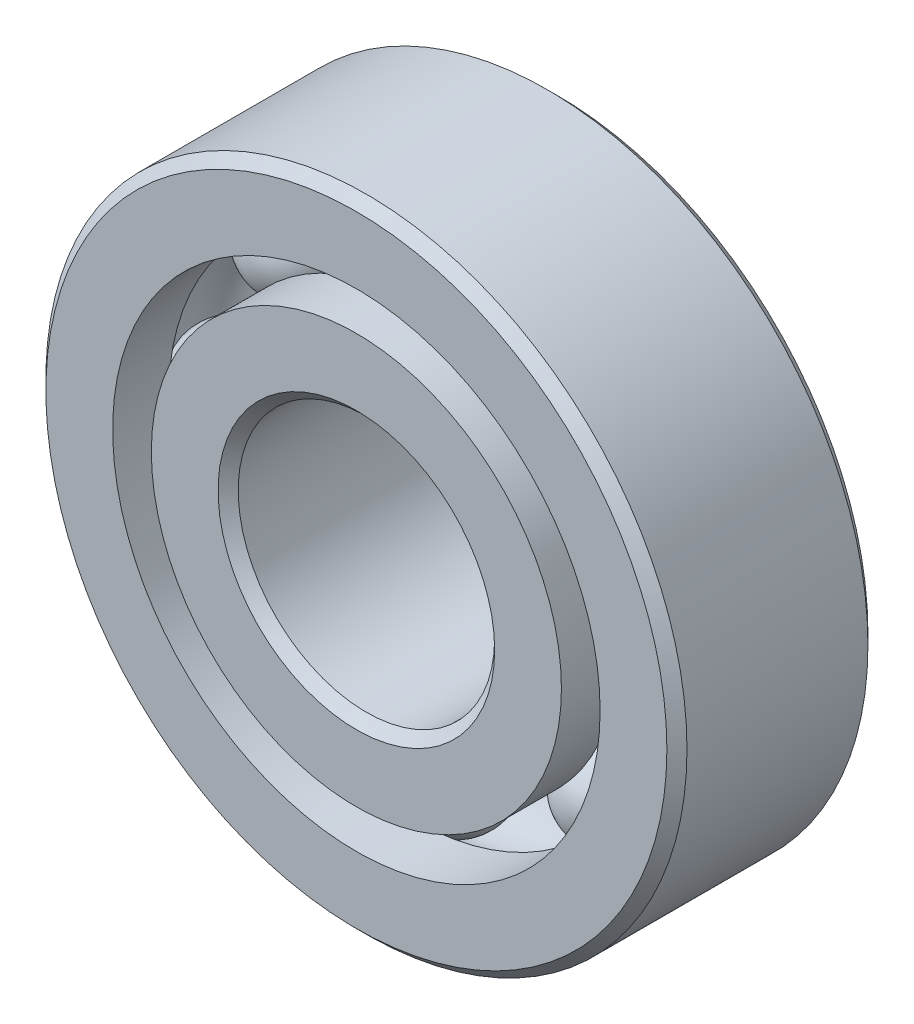
ISO-10303-21;
HEADER;
FILE_DESCRIPTION(('STEP AP214'),'2;1');
FILE_NAME('part.step','',(''),(''),'','','');
FILE_SCHEMA(('AUTOMOTIVE_DESIGN { 1 0 10303 214 1 1 1 1 }'));
ENDSEC;
DATA;
#1=APPLICATION_CONTEXT('core data for automotive mechanical design processes');
#2=APPLICATION_PROTOCOL_DEFINITION('international standard','automotive_design',2000,#1);
#3=PRODUCT_CONTEXT('',#1,'mechanical');
#4=PRODUCT('Part','Part','',(#3));
#5=PRODUCT_RELATED_PRODUCT_CATEGORY('part','',(#4));
#6=PRODUCT_DEFINITION_FORMATION('','',#4);
#7=PRODUCT_DEFINITION_CONTEXT('part definition',#1,'design');
#8=PRODUCT_DEFINITION('design','',#6,#7);
#9=PRODUCT_DEFINITION_SHAPE('','',#8);
#10=(LENGTH_UNIT() NAMED_UNIT(*) SI_UNIT(.MILLI.,.METRE.));
#11=(NAMED_UNIT(*) PLANE_ANGLE_UNIT() SI_UNIT($,.RADIAN.));
#12=(NAMED_UNIT(*) SI_UNIT($,.STERADIAN.) SOLID_ANGLE_UNIT());
#13=UNCERTAINTY_MEASURE_WITH_UNIT(LENGTH_MEASURE(1.E-05),#10,'distance_accuracy_value','');
#14=(GEOMETRIC_REPRESENTATION_CONTEXT(3) GLOBAL_UNCERTAINTY_ASSIGNED_CONTEXT((#13)) GLOBAL_UNIT_ASSIGNED_CONTEXT((#10,
#11,#12)) REPRESENTATION_CONTEXT('',''));
#15=CARTESIAN_POINT('',(0.,0.,0.));
#16=DIRECTION('',(0.,0.,1.));
#17=DIRECTION('',(1.,0.,0.));
#18=AXIS2_PLACEMENT_3D('',#15,#16,#17);
#19=CARTESIAN_POINT('',(-3.92886205296771,3.9288620529678,0.));
#20=DIRECTION('',(0.,0.,1.));
#21=DIRECTION('',(-0.707106781186539,0.707106781186556,0.));
#22=AXIS2_PLACEMENT_3D('',#19,#20,#21);
#23=SPHERICAL_SURFACE('',#22,1.20554465033679);
#24=CARTESIAN_POINT('',(-3.92886205296771,3.9288620529678,1.20554465033679));
#25=VERTEX_POINT('',#24);
#26=VERTEX_LOOP('',#25);
#27=FACE_BOUND('',#26,.T.);
#28=ADVANCED_FACE('F37',(#27),#23,.T.);
#29=CLOSED_SHELL('',(#28));
#30=MANIFOLD_SOLID_BREP('B2',#29);
#31=CARTESIAN_POINT('',(-5.55625,0.,0.));
#32=DIRECTION('',(0.,0.,1.));
#33=DIRECTION('',(-1.,0.,0.));
#34=AXIS2_PLACEMENT_3D('',#31,#32,#33);
#35=SPHERICAL_SURFACE('',#34,1.20554465033679);
#36=CARTESIAN_POINT('',(-5.55625,0.,1.20554465033679));
#37=VERTEX_POINT('',#36);
#38=VERTEX_LOOP('',#37);
#39=FACE_BOUND('',#38,.T.);
#40=ADVANCED_FACE('F57',(#39),#35,.T.);
#41=CLOSED_SHELL('',(#40));
#42=MANIFOLD_SOLID_BREP('B6',#41);
#43=CARTESIAN_POINT('',(-3.92886205296779,-3.92886205296772,0.));
#44=DIRECTION('',(0.,0.,1.));
#45=DIRECTION('',(-0.707106781186554,-0.707106781186541,0.));
#46=AXIS2_PLACEMENT_3D('',#43,#44,#45);
#47=SPHERICAL_SURFACE('',#46,1.20554465033679);
#48=CARTESIAN_POINT('',(-3.92886205296779,-3.92886205296772,1.20554465033679));
#49=VERTEX_POINT('',#48);
#50=VERTEX_LOOP('',#49);
#51=FACE_BOUND('',#50,.T.);
#52=ADVANCED_FACE('F77',(#51),#47,.T.);
#53=CLOSED_SHELL('',(#52));
#54=MANIFOLD_SOLID_BREP('B33',#53);
#55=CARTESIAN_POINT('',(0.,-5.55625,0.));
#56=DIRECTION('',(0.,0.,1.));
#57=DIRECTION('',(0.,-1.,0.));
#58=AXIS2_PLACEMENT_3D('',#55,#56,#57);
#59=SPHERICAL_SURFACE('',#58,1.20554465033679);
#60=CARTESIAN_POINT('',(0.,-5.55625,1.20554465033679));
#61=VERTEX_POINT('',#60);
#62=VERTEX_LOOP('',#61);
#63=FACE_BOUND('',#62,.T.);
#64=ADVANCED_FACE('F97',(#63),#59,.T.);
#65=CLOSED_SHELL('',(#64));
#66=MANIFOLD_SOLID_BREP('B53',#65);
#67=CARTESIAN_POINT('',(3.92886205296773,-3.92886205296777,0.));
#68=DIRECTION('',(0.,0.,1.));
#69=DIRECTION('',(0.707106781186544,-0.707106781186551,0.));
#70=AXIS2_PLACEMENT_3D('',#67,#68,#69);
#71=SPHERICAL_SURFACE('',#70,1.20554465033679);
#72=CARTESIAN_POINT('',(3.92886205296773,-3.92886205296777,1.20554465033679));
#73=VERTEX_POINT('',#72);
#74=VERTEX_LOOP('',#73);
#75=FACE_BOUND('',#74,.T.);
#76=ADVANCED_FACE('F117',(#75),#71,.T.);
#77=CLOSED_SHELL('',(#76));
#78=MANIFOLD_SOLID_BREP('B73',#77);
#79=CARTESIAN_POINT('',(5.55625,0.,0.));
#80=DIRECTION('',(0.,0.,1.));
#81=DIRECTION('',(1.,0.,0.));
#82=AXIS2_PLACEMENT_3D('',#79,#80,#81);
#83=SPHERICAL_SURFACE('',#82,1.20554465033679);
#84=CARTESIAN_POINT('',(5.55625,0.,1.20554465033679));
#85=VERTEX_POINT('',#84);
#86=VERTEX_LOOP('',#85);
#87=FACE_BOUND('',#86,.T.);
#88=ADVANCED_FACE('F137',(#87),#83,.T.);
#89=CLOSED_SHELL('',(#88));
#90=MANIFOLD_SOLID_BREP('B93',#89);
#91=CARTESIAN_POINT('',(3.92886205296776,3.92886205296775,0.));
#92=DIRECTION('',(0.,0.,1.));
#93=DIRECTION('',(0.707106781186549,0.707106781186546,0.));
#94=AXIS2_PLACEMENT_3D('',#91,#92,#93);
#95=SPHERICAL_SURFACE('',#94,1.20554465033679);
#96=CARTESIAN_POINT('',(3.92886205296776,3.92886205296775,1.20554465033679));
#97=VERTEX_POINT('',#96);
#98=VERTEX_LOOP('',#97);
#99=FACE_BOUND('',#98,.T.);
#100=ADVANCED_FACE('F157',(#99),#95,.T.);
#101=CLOSED_SHELL('',(#100));
#102=MANIFOLD_SOLID_BREP('B113',#101);
#103=CARTESIAN_POINT('',(0.,5.55625,0.));
#104=DIRECTION('',(0.,0.,1.));
#105=DIRECTION('',(0.,1.,0.));
#106=AXIS2_PLACEMENT_3D('',#103,#104,#105);
#107=SPHERICAL_SURFACE('',#106,1.20554465033679);
#108=CARTESIAN_POINT('',(0.,5.55625,1.20554465033679));
#109=VERTEX_POINT('',#108);
#110=VERTEX_LOOP('',#109);
#111=FACE_BOUND('',#110,.T.);
#112=ADVANCED_FACE('F179',(#111),#107,.T.);
#113=CLOSED_SHELL('',(#112));
#114=MANIFOLD_SOLID_BREP('B133',#113);
#115=CARTESIAN_POINT('',(0.,5.07727857142857,2.4892));
#116=DIRECTION('',(0.,0.,-1.));
#117=DIRECTION('',(-1.,0.,0.));
#118=AXIS2_PLACEMENT_3D('',#115,#116,#117);
#119=PLANE('',#118);
#120=CARTESIAN_POINT('',(0.,0.,2.4892));
#121=DIRECTION('',(0.,0.,1.));
#122=DIRECTION('',(1.,0.,0.));
#123=AXIS2_PLACEMENT_3D('',#120,#121,#122);
#124=CIRCLE('',#123,3.42392);
#125=CARTESIAN_POINT('',(3.42392,0.,2.4892));
#126=VERTEX_POINT('',#125);
#127=EDGE_CURVE('E226',#126,#126,#124,.T.);
#128=ORIENTED_EDGE('',*,*,#127,.F.);
#129=EDGE_LOOP('',(#128));
#130=FACE_BOUND('',#129,.T.);
#131=CARTESIAN_POINT('',(0.,0.,2.4892));
#132=DIRECTION('',(0.,0.,1.));
#133=DIRECTION('',(1.,0.,0.));
#134=AXIS2_PLACEMENT_3D('',#131,#132,#133);
#135=CIRCLE('',#134,5.07727857142857);
#136=CARTESIAN_POINT('',(5.07727857142857,0.,2.4892));
#137=VERTEX_POINT('',#136);
#138=EDGE_CURVE('E178',#137,#137,#135,.T.);
#139=ORIENTED_EDGE('',*,*,#138,.T.);
#140=EDGE_LOOP('',(#139));
#141=FACE_BOUND('',#140,.T.);
#142=ADVANCED_FACE('F198',(#130,#141),#119,.F.);
#143=CARTESIAN_POINT('',(0.,0.,2.4892));
#144=DIRECTION('',(0.,0.,1.));
#145=DIRECTION('',(1.,0.,0.));
#146=AXIS2_PLACEMENT_3D('',#143,#144,#145);
#147=CYLINDRICAL_SURFACE('',#146,5.07727857142857);
#148=ORIENTED_EDGE('',*,*,#138,.F.);
#149=EDGE_LOOP('',(#148));
#150=FACE_BOUND('',#149,.T.);
#151=CARTESIAN_POINT('',(0.,0.,1.10631111111111));
#152=DIRECTION('',(0.,0.,1.));
#153=DIRECTION('',(1.,0.,0.));
#154=AXIS2_PLACEMENT_3D('',#151,#152,#153);
#155=CIRCLE('',#154,5.07727857142857);
#156=CARTESIAN_POINT('',(5.07727857142857,0.,1.10631111111111));
#157=VERTEX_POINT('',#156);
#158=EDGE_CURVE('E204',#157,#157,#155,.T.);
#159=ORIENTED_EDGE('',*,*,#158,.T.);
#160=EDGE_LOOP('',(#159));
#161=FACE_BOUND('',#160,.T.);
#162=ADVANCED_FACE('F233',(#150,#161),#147,.T.);
#163=CARTESIAN_POINT('',(0.,0.,0.));
#164=DIRECTION('',(0.,0.,1.));
#165=DIRECTION('',(1.,0.,0.));
#166=AXIS2_PLACEMENT_3D('',#163,#164,#165);
#167=TOROIDAL_SURFACE('',#166,5.55625,1.20554465033679);
#168=ORIENTED_EDGE('',*,*,#158,.F.);
#169=EDGE_LOOP('',(#168));
#170=FACE_BOUND('',#169,.T.);
#171=CARTESIAN_POINT('',(0.,0.,-1.10631111111112));
#172=DIRECTION('',(0.,0.,1.));
#173=DIRECTION('',(1.,0.,0.));
#174=AXIS2_PLACEMENT_3D('',#171,#172,#173);
#175=CIRCLE('',#174,5.07727857142857);
#176=CARTESIAN_POINT('',(5.07727857142857,0.,-1.10631111111112));
#177=VERTEX_POINT('',#176);
#178=EDGE_CURVE('E208',#177,#177,#175,.T.);
#179=ORIENTED_EDGE('',*,*,#178,.T.);
#180=EDGE_LOOP('',(#179));
#181=FACE_BOUND('',#180,.T.);
#182=ADVANCED_FACE('F237',(#170,#181),#167,.F.);
#183=CARTESIAN_POINT('',(0.,0.,2.4892));
#184=DIRECTION('',(0.,0.,1.));
#185=DIRECTION('',(1.,0.,0.));
#186=AXIS2_PLACEMENT_3D('',#183,#184,#185);
#187=CYLINDRICAL_SURFACE('',#186,5.07727857142857);
#188=ORIENTED_EDGE('',*,*,#178,.F.);
#189=EDGE_LOOP('',(#188));
#190=FACE_BOUND('',#189,.T.);
#191=CARTESIAN_POINT('',(0.,0.,-2.4892));
#192=DIRECTION('',(0.,0.,1.));
#193=DIRECTION('',(1.,0.,0.));
#194=AXIS2_PLACEMENT_3D('',#191,#192,#193);
#195=CIRCLE('',#194,5.07727857142857);
#196=CARTESIAN_POINT('',(5.07727857142857,0.,-2.4892));
#197=VERTEX_POINT('',#196);
#198=EDGE_CURVE('E212',#197,#197,#195,.T.);
#199=ORIENTED_EDGE('',*,*,#198,.T.);
#200=EDGE_LOOP('',(#199));
#201=FACE_BOUND('',#200,.T.);
#202=ADVANCED_FACE('F242',(#190,#201),#187,.T.);
#203=CARTESIAN_POINT('',(0.,3.42392,-2.4892));
#204=DIRECTION('',(0.,0.,1.));
#205=DIRECTION('',(1.,0.,0.));
#206=AXIS2_PLACEMENT_3D('',#203,#204,#205);
#207=PLANE('',#206);
#208=ORIENTED_EDGE('',*,*,#198,.F.);
#209=EDGE_LOOP('',(#208));
#210=FACE_BOUND('',#209,.T.);
#211=CARTESIAN_POINT('',(0.,0.,-2.4892));
#212=DIRECTION('',(0.,0.,1.));
#213=DIRECTION('',(1.,0.,0.));
#214=AXIS2_PLACEMENT_3D('',#211,#212,#213);
#215=CIRCLE('',#214,3.42392);
#216=CARTESIAN_POINT('',(3.42392,0.,-2.4892));
#217=VERTEX_POINT('',#216);
#218=EDGE_CURVE('E217',#217,#217,#215,.T.);
#219=ORIENTED_EDGE('',*,*,#218,.T.);
#220=EDGE_LOOP('',(#219));
#221=FACE_BOUND('',#220,.T.);
#222=ADVANCED_FACE('F248',(#210,#221),#207,.F.);
#223=CARTESIAN_POINT('',(0.,0.,-2.24028));
#224=DIRECTION('',(0.,0.,-1.));
#225=DIRECTION('',(-1.,0.,0.));
#226=AXIS2_PLACEMENT_3D('',#223,#224,#225);
#227=CONICAL_SURFACE('',#226,3.175,0.785398163397453);
#228=ORIENTED_EDGE('',*,*,#218,.F.);
#229=EDGE_LOOP('',(#228));
#230=FACE_BOUND('',#229,.T.);
#231=CARTESIAN_POINT('',(0.,0.,-2.24028));
#232=DIRECTION('',(0.,0.,1.));
#233=DIRECTION('',(1.,0.,0.));
#234=AXIS2_PLACEMENT_3D('',#231,#232,#233);
#235=CIRCLE('',#234,3.175);
#236=CARTESIAN_POINT('',(3.175,0.,-2.24028));
#237=VERTEX_POINT('',#236);
#238=EDGE_CURVE('E220',#237,#237,#235,.T.);
#239=ORIENTED_EDGE('',*,*,#238,.T.);
#240=EDGE_LOOP('',(#239));
#241=FACE_BOUND('',#240,.T.);
#242=ADVANCED_FACE('F252',(#230,#241),#227,.F.);
#243=CARTESIAN_POINT('',(0.,0.,2.4892));
#244=DIRECTION('',(0.,0.,1.));
#245=DIRECTION('',(1.,0.,0.));
#246=AXIS2_PLACEMENT_3D('',#243,#244,#245);
#247=CYLINDRICAL_SURFACE('',#246,3.175);
#248=ORIENTED_EDGE('',*,*,#238,.F.);
#249=EDGE_LOOP('',(#248));
#250=FACE_BOUND('',#249,.T.);
#251=CARTESIAN_POINT('',(0.,0.,2.24028));
#252=DIRECTION('',(0.,0.,1.));
#253=DIRECTION('',(1.,0.,0.));
#254=AXIS2_PLACEMENT_3D('',#251,#252,#253);
#255=CIRCLE('',#254,3.175);
#256=CARTESIAN_POINT('',(3.175,0.,2.24028));
#257=VERTEX_POINT('',#256);
#258=EDGE_CURVE('E223',#257,#257,#255,.T.);
#259=ORIENTED_EDGE('',*,*,#258,.T.);
#260=EDGE_LOOP('',(#259));
#261=FACE_BOUND('',#260,.T.);
#262=ADVANCED_FACE('F256',(#250,#261),#247,.F.);
#263=CARTESIAN_POINT('',(0.,0.,2.4892));
#264=DIRECTION('',(0.,0.,1.));
#265=DIRECTION('',(1.,0.,0.));
#266=AXIS2_PLACEMENT_3D('',#263,#264,#265);
#267=CONICAL_SURFACE('',#266,3.42392,0.785398163397449);
#268=ORIENTED_EDGE('',*,*,#258,.F.);
#269=EDGE_LOOP('',(#268));
#270=FACE_BOUND('',#269,.T.);
#271=ORIENTED_EDGE('',*,*,#127,.T.);
#272=EDGE_LOOP('',(#271));
#273=FACE_BOUND('',#272,.T.);
#274=ADVANCED_FACE('F230',(#270,#273),#267,.F.);
#275=CLOSED_SHELL('',(#142,#162,#182,#202,#222,#242,#262,#274));
#276=MANIFOLD_SOLID_BREP('B153',#275);
#277=CARTESIAN_POINT('',(0.,0.,2.24028));
#278=DIRECTION('',(0.,0.,-1.));
#279=DIRECTION('',(-1.,0.,0.));
#280=AXIS2_PLACEMENT_3D('',#277,#278,#279);
#281=CONICAL_SURFACE('',#280,7.9375,0.785398163397446);
#282=CARTESIAN_POINT('',(0.,0.,2.4892));
#283=DIRECTION('',(0.,0.,1.));
#284=DIRECTION('',(1.,0.,0.));
#285=AXIS2_PLACEMENT_3D('',#282,#283,#284);
#286=CIRCLE('',#285,7.68858);
#287=CARTESIAN_POINT('',(7.68858,0.,2.4892));
#288=VERTEX_POINT('',#287);
#289=EDGE_CURVE('E347',#288,#288,#286,.T.);
#290=ORIENTED_EDGE('',*,*,#289,.F.);
#291=EDGE_LOOP('',(#290));
#292=FACE_BOUND('',#291,.T.);
#293=CARTESIAN_POINT('',(0.,0.,2.24028));
#294=DIRECTION('',(0.,0.,1.));
#295=DIRECTION('',(1.,0.,0.));
#296=AXIS2_PLACEMENT_3D('',#293,#294,#295);
#297=CIRCLE('',#296,7.9375);
#298=CARTESIAN_POINT('',(7.9375,0.,2.24028));
#299=VERTEX_POINT('',#298);
#300=EDGE_CURVE('E197',#299,#299,#297,.T.);
#301=ORIENTED_EDGE('',*,*,#300,.T.);
#302=EDGE_LOOP('',(#301));
#303=FACE_BOUND('',#302,.T.);
#304=ADVANCED_FACE('F319',(#292,#303),#281,.T.);
#305=CARTESIAN_POINT('',(0.,0.,2.4892));
#306=DIRECTION('',(0.,0.,1.));
#307=DIRECTION('',(1.,0.,0.));
#308=AXIS2_PLACEMENT_3D('',#305,#306,#307);
#309=CYLINDRICAL_SURFACE('',#308,7.9375);
#310=ORIENTED_EDGE('',*,*,#300,.F.);
#311=EDGE_LOOP('',(#310));
#312=FACE_BOUND('',#311,.T.);
#313=CARTESIAN_POINT('',(0.,0.,-2.24028));
#314=DIRECTION('',(0.,0.,1.));
#315=DIRECTION('',(1.,0.,0.));
#316=AXIS2_PLACEMENT_3D('',#313,#314,#315);
#317=CIRCLE('',#316,7.9375);
#318=CARTESIAN_POINT('',(7.9375,0.,-2.24028));
#319=VERTEX_POINT('',#318);
#320=EDGE_CURVE('E325',#319,#319,#317,.T.);
#321=ORIENTED_EDGE('',*,*,#320,.T.);
#322=EDGE_LOOP('',(#321));
#323=FACE_BOUND('',#322,.T.);
#324=ADVANCED_FACE('F354',(#312,#323),#309,.T.);
#325=CARTESIAN_POINT('',(0.,0.,-2.4892));
#326=DIRECTION('',(0.,0.,1.));
#327=DIRECTION('',(1.,0.,0.));
#328=AXIS2_PLACEMENT_3D('',#325,#326,#327);
#329=CONICAL_SURFACE('',#328,7.68858,0.785398163397445);
#330=ORIENTED_EDGE('',*,*,#320,.F.);
#331=EDGE_LOOP('',(#330));
#332=FACE_BOUND('',#331,.T.);
#333=CARTESIAN_POINT('',(0.,0.,-2.4892));
#334=DIRECTION('',(0.,0.,1.));
#335=DIRECTION('',(1.,0.,0.));
#336=AXIS2_PLACEMENT_3D('',#333,#334,#335);
#337=CIRCLE('',#336,7.68858);
#338=CARTESIAN_POINT('',(7.68858,0.,-2.4892));
#339=VERTEX_POINT('',#338);
#340=EDGE_CURVE('E329',#339,#339,#337,.T.);
#341=ORIENTED_EDGE('',*,*,#340,.T.);
#342=EDGE_LOOP('',(#341));
#343=FACE_BOUND('',#342,.T.);
#344=ADVANCED_FACE('F358',(#332,#343),#329,.T.);
#345=CARTESIAN_POINT('',(0.,7.68858,-2.4892));
#346=DIRECTION('',(0.,0.,1.));
#347=DIRECTION('',(1.,0.,0.));
#348=AXIS2_PLACEMENT_3D('',#345,#346,#347);
#349=PLANE('',#348);
#350=ORIENTED_EDGE('',*,*,#340,.F.);
#351=EDGE_LOOP('',(#350));
#352=FACE_BOUND('',#351,.T.);
#353=CARTESIAN_POINT('',(0.,0.,-2.4892));
#354=DIRECTION('',(0.,0.,1.));
#355=DIRECTION('',(1.,0.,0.));
#356=AXIS2_PLACEMENT_3D('',#353,#354,#355);
#357=CIRCLE('',#356,6.03522142857143);
#358=CARTESIAN_POINT('',(6.03522142857143,0.,-2.4892));
#359=VERTEX_POINT('',#358);
#360=EDGE_CURVE('E333',#359,#359,#357,.T.);
#361=ORIENTED_EDGE('',*,*,#360,.T.);
#362=EDGE_LOOP('',(#361));
#363=FACE_BOUND('',#362,.T.);
#364=ADVANCED_FACE('F363',(#352,#363),#349,.F.);
#365=CARTESIAN_POINT('',(0.,0.,2.4892));
#366=DIRECTION('',(0.,0.,1.));
#367=DIRECTION('',(1.,0.,0.));
#368=AXIS2_PLACEMENT_3D('',#365,#366,#367);
#369=CYLINDRICAL_SURFACE('',#368,6.03522142857143);
#370=ORIENTED_EDGE('',*,*,#360,.F.);
#371=EDGE_LOOP('',(#370));
#372=FACE_BOUND('',#371,.T.);
#373=CARTESIAN_POINT('',(0.,0.,-1.10631111111111));
#374=DIRECTION('',(0.,0.,1.));
#375=DIRECTION('',(1.,0.,0.));
#376=AXIS2_PLACEMENT_3D('',#373,#374,#375);
#377=CIRCLE('',#376,6.03522142857143);
#378=CARTESIAN_POINT('',(6.03522142857143,0.,-1.10631111111111));
#379=VERTEX_POINT('',#378);
#380=EDGE_CURVE('E338',#379,#379,#377,.T.);
#381=ORIENTED_EDGE('',*,*,#380,.T.);
#382=EDGE_LOOP('',(#381));
#383=FACE_BOUND('',#382,.T.);
#384=ADVANCED_FACE('F369',(#372,#383),#369,.F.);
#385=CARTESIAN_POINT('',(0.,0.,0.));
#386=DIRECTION('',(0.,0.,1.));
#387=DIRECTION('',(1.,0.,0.));
#388=AXIS2_PLACEMENT_3D('',#385,#386,#387);
#389=TOROIDAL_SURFACE('',#388,5.55625,1.20554465033679);
#390=ORIENTED_EDGE('',*,*,#380,.F.);
#391=EDGE_LOOP('',(#390));
#392=FACE_BOUND('',#391,.T.);
#393=CARTESIAN_POINT('',(0.,0.,1.10631111111111));
#394=DIRECTION('',(0.,0.,1.));
#395=DIRECTION('',(1.,0.,0.));
#396=AXIS2_PLACEMENT_3D('',#393,#394,#395);
#397=CIRCLE('',#396,6.03522142857143);
#398=CARTESIAN_POINT('',(6.03522142857143,0.,1.10631111111111));
#399=VERTEX_POINT('',#398);
#400=EDGE_CURVE('E341',#399,#399,#397,.T.);
#401=ORIENTED_EDGE('',*,*,#400,.T.);
#402=EDGE_LOOP('',(#401));
#403=FACE_BOUND('',#402,.T.);
#404=ADVANCED_FACE('F373',(#392,#403),#389,.F.);
#405=CARTESIAN_POINT('',(0.,0.,2.4892));
#406=DIRECTION('',(0.,0.,1.));
#407=DIRECTION('',(1.,0.,0.));
#408=AXIS2_PLACEMENT_3D('',#405,#406,#407);
#409=CYLINDRICAL_SURFACE('',#408,6.03522142857143);
#410=ORIENTED_EDGE('',*,*,#400,.F.);
#411=EDGE_LOOP('',(#410));
#412=FACE_BOUND('',#411,.T.);
#413=CARTESIAN_POINT('',(0.,0.,2.4892));
#414=DIRECTION('',(0.,0.,1.));
#415=DIRECTION('',(1.,0.,0.));
#416=AXIS2_PLACEMENT_3D('',#413,#414,#415);
#417=CIRCLE('',#416,6.03522142857143);
#418=CARTESIAN_POINT('',(6.03522142857143,0.,2.4892));
#419=VERTEX_POINT('',#418);
#420=EDGE_CURVE('E344',#419,#419,#417,.T.);
#421=ORIENTED_EDGE('',*,*,#420,.T.);
#422=EDGE_LOOP('',(#421));
#423=FACE_BOUND('',#422,.T.);
#424=ADVANCED_FACE('F377',(#412,#423),#409,.F.);
#425=CARTESIAN_POINT('',(0.,7.68858,2.4892));
#426=DIRECTION('',(0.,0.,-1.));
#427=DIRECTION('',(-1.,0.,0.));
#428=AXIS2_PLACEMENT_3D('',#425,#426,#427);
#429=PLANE('',#428);
#430=ORIENTED_EDGE('',*,*,#420,.F.);
#431=EDGE_LOOP('',(#430));
#432=FACE_BOUND('',#431,.T.);
#433=ORIENTED_EDGE('',*,*,#289,.T.);
#434=EDGE_LOOP('',(#433));
#435=FACE_BOUND('',#434,.T.);
#436=ADVANCED_FACE('F351',(#432,#435),#429,.F.);
#437=CLOSED_SHELL('',(#304,#324,#344,#364,#384,#404,#424,#436));
#438=MANIFOLD_SOLID_BREP('B173',#437);
#439=ADVANCED_BREP_SHAPE_REPRESENTATION('',(#18,#30,#42,#54,#66,#78,#90,#102,#114,#276,#438),#14);
#440=SHAPE_DEFINITION_REPRESENTATION(#9,#439);
ENDSEC;
END-ISO-10303-21;
